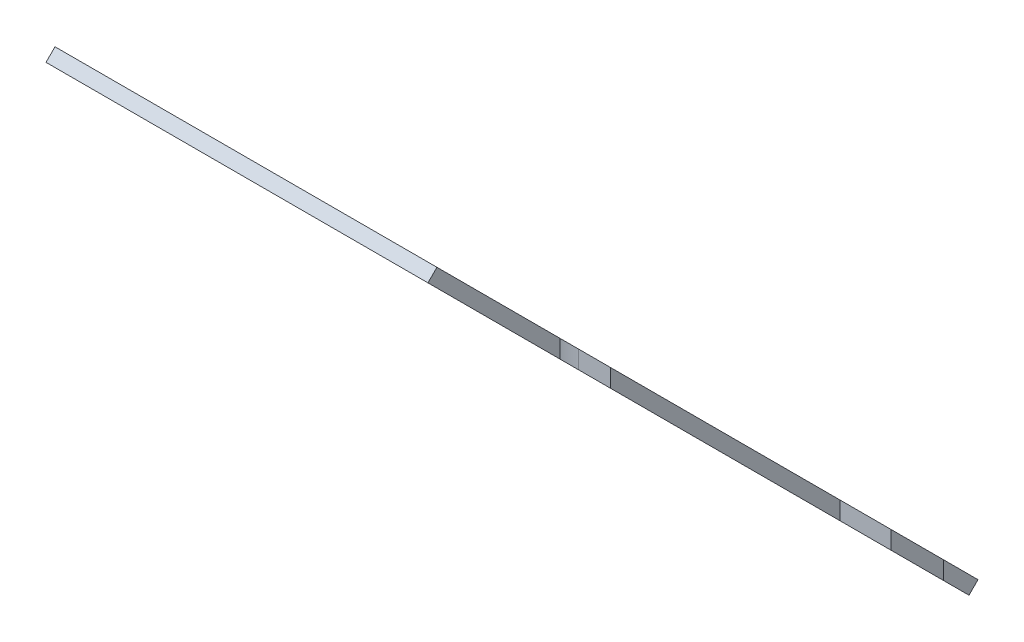
ISO-10303-21;
HEADER;
FILE_DESCRIPTION(('STEP AP214'),'2;1');
FILE_NAME('part.step','',(''),(''),'','','');
FILE_SCHEMA(('AUTOMOTIVE_DESIGN { 1 0 10303 214 1 1 1 1 }'));
ENDSEC;
DATA;
#1=APPLICATION_CONTEXT('core data for automotive mechanical design processes');
#2=APPLICATION_PROTOCOL_DEFINITION('international standard','automotive_design',2000,#1);
#3=PRODUCT_CONTEXT('',#1,'mechanical');
#4=PRODUCT('Part','Part','',(#3));
#5=PRODUCT_RELATED_PRODUCT_CATEGORY('part','',(#4));
#6=PRODUCT_DEFINITION_FORMATION('','',#4);
#7=PRODUCT_DEFINITION_CONTEXT('part definition',#1,'design');
#8=PRODUCT_DEFINITION('design','',#6,#7);
#9=PRODUCT_DEFINITION_SHAPE('','',#8);
#10=(LENGTH_UNIT() NAMED_UNIT(*) SI_UNIT(.MILLI.,.METRE.));
#11=(NAMED_UNIT(*) PLANE_ANGLE_UNIT() SI_UNIT($,.RADIAN.));
#12=(NAMED_UNIT(*) SI_UNIT($,.STERADIAN.) SOLID_ANGLE_UNIT());
#13=UNCERTAINTY_MEASURE_WITH_UNIT(LENGTH_MEASURE(1.E-05),#10,'distance_accuracy_value','');
#14=(GEOMETRIC_REPRESENTATION_CONTEXT(3) GLOBAL_UNCERTAINTY_ASSIGNED_CONTEXT((#13)) GLOBAL_UNIT_ASSIGNED_CONTEXT((#10,
#11,#12)) REPRESENTATION_CONTEXT('',''));
#15=CARTESIAN_POINT('',(0.,0.,0.));
#16=DIRECTION('',(0.,0.,1.));
#17=DIRECTION('',(1.,0.,0.));
#18=AXIS2_PLACEMENT_3D('',#15,#16,#17);
#19=CARTESIAN_POINT('',(-23399.5611417374,4827.85712854684,40199.9001960557));
#20=DIRECTION('',(0.,0.,-1.));
#21=DIRECTION('',(-1.,0.,0.));
#22=AXIS2_PLACEMENT_3D('',#19,#20,#21);
#23=PLANE('',#22);
#24=DIRECTION('',(1.,0.,0.));
#25=VECTOR('',#24,1.);
#26=CARTESIAN_POINT('',(-23399.5611417374,2810.99010375556,40199.9001960557));
#27=LINE('',#26,#25);
#28=CARTESIAN_POINT('',(-22901.5611417374,2810.99010375556,40199.9001960557));
#29=VERTEX_POINT('',#28);
#30=CARTESIAN_POINT('',(-22799.5611417374,2810.99010375556,40199.9001960557));
#31=VERTEX_POINT('',#30);
#32=EDGE_CURVE('E550',#29,#31,#27,.T.);
#33=ORIENTED_EDGE('',*,*,#32,.F.);
#34=DIRECTION('',(0.,1.,0.));
#35=VECTOR('',#34,1.);
#36=CARTESIAN_POINT('',(-22901.5611417374,0.,40199.9001960557));
#37=LINE('',#36,#35);
#38=CARTESIAN_POINT('',(-22901.5611417374,2839.27437500302,40199.9001960557));
#39=VERTEX_POINT('',#38);
#40=EDGE_CURVE('E492',#29,#39,#37,.T.);
#41=ORIENTED_EDGE('',*,*,#40,.T.);
#42=DIRECTION('',(1.,0.,0.));
#43=VECTOR('',#42,1.);
#44=CARTESIAN_POINT('',(-23399.5611417374,2839.27437500302,40199.9001960557));
#45=LINE('',#44,#43);
#46=CARTESIAN_POINT('',(-22799.5611417374,2839.27437500302,40199.9001960557));
#47=VERTEX_POINT('',#46);
#48=EDGE_CURVE('E571',#39,#47,#45,.T.);
#49=ORIENTED_EDGE('',*,*,#48,.T.);
#50=DIRECTION('',(0.,1.,0.));
#51=VECTOR('',#50,1.);
#52=CARTESIAN_POINT('',(-22799.5611417374,4827.85712854684,40199.9001960557));
#53=LINE('',#52,#51);
#54=EDGE_CURVE('E554',#31,#47,#53,.T.);
#55=ORIENTED_EDGE('',*,*,#54,.F.);
#56=EDGE_LOOP('',(#33,#41,#49,#55));
#57=FACE_BOUND('',#56,.T.);
#58=ADVANCED_FACE('F135',(#57),#23,.T.);
#59=CARTESIAN_POINT('',(-22799.5611417376,0.,1.12500434359583E-10));
#60=DIRECTION('',(-1.,0.,0.));
#61=DIRECTION('',(0.,0.,1.));
#62=AXIS2_PLACEMENT_3D('',#59,#60,#61);
#63=PLANE('',#62);
#64=DIRECTION('',(0.,-0.70710678118655,-0.707106781186545));
#65=VECTOR('',#64,1.);
#66=CARTESIAN_POINT('',(-22799.5611417374,3819.42361615121,41208.3337084514));
#67=LINE('',#66,#65);
#68=CARTESIAN_POINT('',(-22799.5611417374,3333.6901037565,40722.6001960567));
#69=VERTEX_POINT('',#68);
#70=CARTESIAN_POINT('',(-22799.5611417374,2973.69010375672,40362.6001960569));
#71=VERTEX_POINT('',#70);
#72=EDGE_CURVE('E555',#69,#71,#67,.T.);
#73=ORIENTED_EDGE('',*,*,#72,.T.);
#74=DIRECTION('',(0.,1.,0.));
#75=VECTOR('',#74,1.);
#76=CARTESIAN_POINT('',(-22799.5611417374,0.,40362.6001960569));
#77=LINE('',#76,#75);
#78=CARTESIAN_POINT('',(-22799.5611417374,3001.97437500418,40362.6001960569));
#79=VERTEX_POINT('',#78);
#80=EDGE_CURVE('E582',#71,#79,#77,.T.);
#81=ORIENTED_EDGE('',*,*,#80,.T.);
#82=DIRECTION('',(0.,0.707106781186551,0.707106781186544));
#83=VECTOR('',#82,1.);
#84=CARTESIAN_POINT('',(-22799.5611417374,3833.56575177494,41194.1915728277));
#85=LINE('',#84,#83);
#86=CARTESIAN_POINT('',(-22799.5611417374,3361.97437500396,40722.6001960567));
#87=VERTEX_POINT('',#86);
#88=EDGE_CURVE('E562',#79,#87,#85,.T.);
#89=ORIENTED_EDGE('',*,*,#88,.T.);
#90=DIRECTION('',(0.,-1.,0.));
#91=VECTOR('',#90,1.);
#92=CARTESIAN_POINT('',(-22799.5611417374,0.,40722.6001960567));
#93=LINE('',#92,#91);
#94=EDGE_CURVE('E567',#87,#69,#93,.T.);
#95=ORIENTED_EDGE('',*,*,#94,.T.);
#96=EDGE_LOOP('',(#73,#81,#89,#95));
#97=FACE_BOUND('',#96,.T.);
#98=ADVANCED_FACE('F603',(#97),#63,.F.);
#99=CARTESIAN_POINT('',(-22799.5611417374,3620.81394389631,41009.7240361965));
#100=VERTEX_POINT('',#99);
#101=CARTESIAN_POINT('',(-22799.5611417374,3413.6901037565,40802.6001960567));
#102=VERTEX_POINT('',#101);
#103=EDGE_CURVE('E551',#100,#102,#67,.T.);
#104=ORIENTED_EDGE('',*,*,#103,.T.);
#105=DIRECTION('',(0.,1.,0.));
#106=VECTOR('',#105,1.);
#107=CARTESIAN_POINT('',(-22799.5611417374,0.,40802.6001960567));
#108=LINE('',#107,#106);
#109=CARTESIAN_POINT('',(-22799.5611417374,3441.97437500396,40802.6001960567));
#110=VERTEX_POINT('',#109);
#111=EDGE_CURVE('E576',#102,#110,#108,.T.);
#112=ORIENTED_EDGE('',*,*,#111,.T.);
#113=CARTESIAN_POINT('',(-22799.5611417374,3634.95607952004,40995.5819005727));
#114=VERTEX_POINT('',#113);
#115=EDGE_CURVE('E558',#110,#114,#85,.T.);
#116=ORIENTED_EDGE('',*,*,#115,.T.);
#117=DIRECTION('',(0.,-0.70710678118657,0.707106781186525));
#118=VECTOR('',#117,1.);
#119=CARTESIAN_POINT('',(-22799.5611417374,4629.24745629198,40001.2905238009));
#120=LINE('',#119,#118);
#121=EDGE_CURVE('E544',#114,#100,#120,.T.);
#122=ORIENTED_EDGE('',*,*,#121,.T.);
#123=EDGE_LOOP('',(#104,#112,#116,#122));
#124=FACE_BOUND('',#123,.T.);
#125=ADVANCED_FACE('F644',(#124),#63,.F.);
#126=CARTESIAN_POINT('',(-23399.5611417374,3819.42361615121,41208.3337084514));
#127=DIRECTION('',(0.,-0.707106781186545,0.70710678118655));
#128=DIRECTION('',(0.,-0.70710678118655,-0.707106781186545));
#129=AXIS2_PLACEMENT_3D('',#126,#127,#128);
#130=PLANE('',#129);
#131=CARTESIAN_POINT('',(-23359.5611417374,2792.61401178209,40181.5241040823));
#132=DIRECTION('',(0.,-0.707106781186545,0.70710678118655));
#133=DIRECTION('',(0.,-0.70710678118655,-0.707106781186545));
#134=AXIS2_PLACEMENT_3D('',#131,#132,#133);
#135=CIRCLE('',#134,10.0000000000051);
#136=CARTESIAN_POINT('',(-23369.5611417374,2792.61401178209,40181.5241040823));
#137=VERTEX_POINT('',#136);
#138=CARTESIAN_POINT('',(-23359.5611417374,2785.54294397022,40174.4530362704));
#139=VERTEX_POINT('',#138);
#140=EDGE_CURVE('E461',#137,#139,#135,.T.);
#141=ORIENTED_EDGE('',*,*,#140,.F.);
#142=DIRECTION('',(0.,-0.70710678118655,-0.707106781186545));
#143=VECTOR('',#142,1.);
#144=CARTESIAN_POINT('',(-23369.5611417374,3819.42361615121,41208.3337084514));
#145=LINE('',#144,#143);
#146=CARTESIAN_POINT('',(-23369.5611417374,3359.7136502937,40748.6237425939));
#147=VERTEX_POINT('',#146);
#148=EDGE_CURVE('E451',#147,#137,#145,.T.);
#149=ORIENTED_EDGE('',*,*,#148,.F.);
#150=CARTESIAN_POINT('',(-23359.5611417374,3359.7136502937,40748.6237425939));
#151=DIRECTION('',(0.,-0.707106781186545,0.70710678118655));
#152=DIRECTION('',(0.,-0.70710678118655,-0.707106781186545));
#153=AXIS2_PLACEMENT_3D('',#150,#151,#152);
#154=CIRCLE('',#153,10.000000000001);
#155=CARTESIAN_POINT('',(-23359.5611417374,3366.78471810557,40755.6948104057));
#156=VERTEX_POINT('',#155);
#157=EDGE_CURVE('E486',#156,#147,#154,.T.);
#158=ORIENTED_EDGE('',*,*,#157,.F.);
#159=DIRECTION('',(-1.,0.,0.));
#160=VECTOR('',#159,1.);
#161=CARTESIAN_POINT('',(-23399.5611417374,3366.78471810557,40755.6948104057));
#162=LINE('',#161,#160);
#163=CARTESIAN_POINT('',(-22990.4388582626,3366.78471810557,40755.6948104057));
#164=VERTEX_POINT('',#163);
#165=EDGE_CURVE('E480',#164,#156,#162,.T.);
#166=ORIENTED_EDGE('',*,*,#165,.F.);
#167=CARTESIAN_POINT('',(-22990.4388582626,3359.7136502937,40748.6237425939));
#168=DIRECTION('',(0.,-0.707106781186545,0.70710678118655));
#169=DIRECTION('',(0.,-0.70710678118655,-0.707106781186545));
#170=AXIS2_PLACEMENT_3D('',#167,#168,#169);
#171=CIRCLE('',#170,10.000000000001);
#172=CARTESIAN_POINT('',(-22990.4388582626,3352.64258248184,40741.552674782));
#173=VERTEX_POINT('',#172);
#174=EDGE_CURVE('E351',#173,#164,#171,.T.);
#175=ORIENTED_EDGE('',*,*,#174,.F.);
#176=DIRECTION('',(-1.,0.,0.));
#177=VECTOR('',#176,1.);
#178=CARTESIAN_POINT('',(-23399.5611417374,3352.64258248184,40741.552674782));
#179=LINE('',#178,#177);
#180=CARTESIAN_POINT('',(-23349.5611417374,3352.64258248184,40741.552674782));
#181=VERTEX_POINT('',#180);
#182=EDGE_CURVE('E483',#173,#181,#179,.T.);
#183=ORIENTED_EDGE('',*,*,#182,.T.);
#184=DIRECTION('',(0.,-0.70710678118655,-0.707106781186545));
#185=VECTOR('',#184,1.);
#186=CARTESIAN_POINT('',(-23349.5611417374,3819.42361615121,41208.3337084514));
#187=LINE('',#186,#185);
#188=CARTESIAN_POINT('',(-23349.5611417374,3239.50549749199,40628.4155897922));
#189=VERTEX_POINT('',#188);
#190=EDGE_CURVE('E381',#181,#189,#187,.T.);
#191=ORIENTED_EDGE('',*,*,#190,.T.);
#192=DIRECTION('',(-1.,0.,0.));
#193=VECTOR('',#192,1.);
#194=CARTESIAN_POINT('',(-23399.5611417374,3239.50549749199,40628.4155897922));
#195=LINE('',#194,#193);
#196=CARTESIAN_POINT('',(-22990.4388582626,3239.50549749199,40628.4155897922));
#197=VERTEX_POINT('',#196);
#198=EDGE_CURVE('E449',#197,#189,#195,.T.);
#199=ORIENTED_EDGE('',*,*,#198,.F.);
#200=CARTESIAN_POINT('',(-22990.4388582626,3232.43442968012,40621.3445219803));
#201=DIRECTION('',(0.,-0.707106781186545,0.70710678118655));
#202=DIRECTION('',(0.,-0.70710678118655,-0.707106781186545));
#203=AXIS2_PLACEMENT_3D('',#200,#201,#202);
#204=CIRCLE('',#203,10.0000000000048);
#205=CARTESIAN_POINT('',(-22990.4388582626,3225.36336186825,40614.2734541684));
#206=VERTEX_POINT('',#205);
#207=EDGE_CURVE('E453',#206,#197,#204,.T.);
#208=ORIENTED_EDGE('',*,*,#207,.F.);
#209=DIRECTION('',(-1.,0.,0.));
#210=VECTOR('',#209,1.);
#211=CARTESIAN_POINT('',(-23399.5611417374,3225.36336186825,40614.2734541684));
#212=LINE('',#211,#210);
#213=CARTESIAN_POINT('',(-23349.5611417374,3225.36336186825,40614.2734541684));
#214=VERTEX_POINT('',#213);
#215=EDGE_CURVE('E455',#206,#214,#212,.T.);
#216=ORIENTED_EDGE('',*,*,#215,.T.);
#217=DIRECTION('',(0.,-0.70710678118655,-0.707106781186545));
#218=VECTOR('',#217,1.);
#219=CARTESIAN_POINT('',(-23349.5611417374,3819.42361615121,41208.3337084514));
#220=LINE('',#219,#218);
#221=CARTESIAN_POINT('',(-23349.5611417374,2926.96430020753,40315.8743925077));
#222=VERTEX_POINT('',#221);
#223=EDGE_CURVE('E458',#214,#222,#220,.T.);
#224=ORIENTED_EDGE('',*,*,#223,.T.);
#225=DIRECTION('',(1.,0.,0.));
#226=VECTOR('',#225,1.);
#227=CARTESIAN_POINT('',(-23399.5611417374,2926.96430020753,40315.8743925077));
#228=LINE('',#227,#226);
#229=CARTESIAN_POINT('',(-23159.5611417374,2926.96430020753,40315.8743925077));
#230=VERTEX_POINT('',#229);
#231=EDGE_CURVE('E463',#222,#230,#228,.T.);
#232=ORIENTED_EDGE('',*,*,#231,.T.);
#233=CARTESIAN_POINT('',(-23159.5611417374,2919.89323239567,40308.8033246958));
#234=DIRECTION('',(0.,-0.707106781186545,0.70710678118655));
#235=DIRECTION('',(0.,-0.70710678118655,-0.707106781186545));
#236=AXIS2_PLACEMENT_3D('',#233,#234,#235);
#237=CIRCLE('',#236,9.99999999999973);
#238=CARTESIAN_POINT('',(-23159.5611417374,2912.8221645838,40301.732256884));
#239=VERTEX_POINT('',#238);
#240=EDGE_CURVE('E471',#239,#230,#237,.T.);
#241=ORIENTED_EDGE('',*,*,#240,.F.);
#242=DIRECTION('',(1.,0.,0.));
#243=VECTOR('',#242,1.);
#244=CARTESIAN_POINT('',(-23399.5611417374,2912.8221645838,40301.732256884));
#245=LINE('',#244,#243);
#246=CARTESIAN_POINT('',(-23349.5611417374,2912.8221645838,40301.732256884));
#247=VERTEX_POINT('',#246);
#248=EDGE_CURVE('E473',#247,#239,#245,.T.);
#249=ORIENTED_EDGE('',*,*,#248,.F.);
#250=DIRECTION('',(0.,-0.70710678118655,-0.707106781186545));
#251=VECTOR('',#250,1.);
#252=CARTESIAN_POINT('',(-23349.5611417374,3819.42361615121,41208.3337084514));
#253=LINE('',#252,#251);
#254=CARTESIAN_POINT('',(-23349.5611417374,2799.68507959396,40188.5951718941));
#255=VERTEX_POINT('',#254);
#256=EDGE_CURVE('E466',#247,#255,#253,.T.);
#257=ORIENTED_EDGE('',*,*,#256,.T.);
#258=DIRECTION('',(1.,0.,0.));
#259=VECTOR('',#258,1.);
#260=CARTESIAN_POINT('',(-23399.5611417374,2799.68507959396,40188.5951718941));
#261=LINE('',#260,#259);
#262=CARTESIAN_POINT('',(-23159.5611417374,2799.68507959396,40188.5951718941));
#263=VERTEX_POINT('',#262);
#264=EDGE_CURVE('E475',#255,#263,#261,.T.);
#265=ORIENTED_EDGE('',*,*,#264,.T.);
#266=CARTESIAN_POINT('',(-23159.5611417374,2792.61401178209,40181.5241040823));
#267=DIRECTION('',(0.,-0.707106781186545,0.70710678118655));
#268=DIRECTION('',(0.,-0.70710678118655,-0.707106781186545));
#269=AXIS2_PLACEMENT_3D('',#266,#267,#268);
#270=CIRCLE('',#269,10.0000000000035);
#271=CARTESIAN_POINT('',(-23159.5611417374,2785.54294397022,40174.4530362704));
#272=VERTEX_POINT('',#271);
#273=EDGE_CURVE('E478',#272,#263,#270,.T.);
#274=ORIENTED_EDGE('',*,*,#273,.F.);
#275=DIRECTION('',(1.,0.,0.));
#276=VECTOR('',#275,1.);
#277=CARTESIAN_POINT('',(-23399.5611417374,2785.54294397022,40174.4530362704));
#278=LINE('',#277,#276);
#279=EDGE_CURVE('E469',#139,#272,#278,.T.);
#280=ORIENTED_EDGE('',*,*,#279,.F.);
#281=EDGE_LOOP('',(#141,#149,#158,#166,#175,#183,#191,#199,#208,#216,#224,#232,#241,#249,#257,
#265,#274,#280));
#282=FACE_BOUND('',#281,.T.);
#283=DIRECTION('',(-1.,0.,0.));
#284=VECTOR('',#283,1.);
#285=CARTESIAN_POINT('',(-23399.5611417374,2973.69010375672,40362.6001960569));
#286=LINE('',#285,#284);
#287=CARTESIAN_POINT('',(-23030.5611417375,2973.69010375672,40362.6001960569));
#288=VERTEX_POINT('',#287);
#289=EDGE_CURVE('E534',#71,#288,#286,.T.);
#290=ORIENTED_EDGE('',*,*,#289,.F.);
#291=ORIENTED_EDGE('',*,*,#72,.F.);
#292=DIRECTION('',(1.,0.,0.));
#293=VECTOR('',#292,1.);
#294=CARTESIAN_POINT('',(-23399.5611417374,3333.69010375651,40722.6001960567));
#295=LINE('',#294,#293);
#296=CARTESIAN_POINT('',(-22850.5611417385,3333.69010375651,40722.6001960567));
#297=VERTEX_POINT('',#296);
#298=EDGE_CURVE('E522',#297,#69,#295,.T.);
#299=ORIENTED_EDGE('',*,*,#298,.F.);
#300=CARTESIAN_POINT('',(-22850.5611417385,3373.6901037565,40762.6001960567));
#301=DIRECTION('',(0.,-0.707106781186545,0.70710678118655));
#302=DIRECTION('',(0.,0.70710678118655,0.707106781186545));
#303=AXIS2_PLACEMENT_3D('',#300,#301,#302);
#304=ELLIPSE('',#303,56.5685424949228,39.9999999999991);
#305=CARTESIAN_POINT('',(-22850.5611417385,3413.6901037565,40802.6001960567));
#306=VERTEX_POINT('',#305);
#307=EDGE_CURVE('E536',#306,#297,#304,.T.);
#308=ORIENTED_EDGE('',*,*,#307,.F.);
#309=DIRECTION('',(-1.,0.,0.));
#310=VECTOR('',#309,1.);
#311=CARTESIAN_POINT('',(-23399.5611417374,3413.6901037565,40802.6001960567));
#312=LINE('',#311,#310);
#313=EDGE_CURVE('E526',#102,#306,#312,.T.);
#314=ORIENTED_EDGE('',*,*,#313,.F.);
#315=ORIENTED_EDGE('',*,*,#103,.F.);
#316=DIRECTION('',(1.,0.,0.));
#317=VECTOR('',#316,1.);
#318=CARTESIAN_POINT('',(-23399.5611417374,3620.81394389631,41009.7240361965));
#319=LINE('',#318,#317);
#320=CARTESIAN_POINT('',(-23399.5611417374,3620.81394389631,41009.7240361965));
#321=VERTEX_POINT('',#320);
#322=EDGE_CURVE('E565',#321,#100,#319,.T.);
#323=ORIENTED_EDGE('',*,*,#322,.F.);
#324=DIRECTION('',(0.,-0.70710678118655,-0.707106781186545));
#325=VECTOR('',#324,1.);
#326=CARTESIAN_POINT('',(-23399.5611417374,3819.42361615121,41208.3337084514));
#327=LINE('',#326,#325);
#328=CARTESIAN_POINT('',(-23399.5611417374,2668.87032507444,40057.7804173746));
#329=VERTEX_POINT('',#328);
#330=EDGE_CURVE('E541',#321,#329,#327,.T.);
#331=ORIENTED_EDGE('',*,*,#330,.T.);
#332=DIRECTION('',(-1.,0.,0.));
#333=VECTOR('',#332,1.);
#334=CARTESIAN_POINT('',(-22670.3570628498,2668.87032507444,40057.7804173746));
#335=LINE('',#334,#333);
#336=CARTESIAN_POINT('',(-22901.5611417374,2668.87032507444,40057.7804173746));
#337=VERTEX_POINT('',#336);
#338=EDGE_CURVE('E493',#337,#329,#335,.T.);
#339=ORIENTED_EDGE('',*,*,#338,.F.);
#340=DIRECTION('',(0.,0.707106781186551,0.707106781186544));
#341=VECTOR('',#340,1.);
#342=CARTESIAN_POINT('',(-22901.5611417374,-18694.4550461501,18694.4550461503));
#343=LINE('',#342,#341);
#344=EDGE_CURVE('E489',#337,#29,#343,.T.);
#345=ORIENTED_EDGE('',*,*,#344,.T.);
#346=ORIENTED_EDGE('',*,*,#32,.T.);
#347=CARTESIAN_POINT('',(-22799.5611417374,2893.69010375672,40282.6001960569));
#348=VERTEX_POINT('',#347);
#349=EDGE_CURVE('E540',#348,#31,#67,.T.);
#350=ORIENTED_EDGE('',*,*,#349,.F.);
#351=DIRECTION('',(1.,0.,0.));
#352=VECTOR('',#351,1.);
#353=CARTESIAN_POINT('',(-23399.5611417374,2893.69010375672,40282.6001960569));
#354=LINE('',#353,#352);
#355=CARTESIAN_POINT('',(-23030.5611417375,2893.69010375672,40282.6001960569));
#356=VERTEX_POINT('',#355);
#357=EDGE_CURVE('E530',#356,#348,#354,.T.);
#358=ORIENTED_EDGE('',*,*,#357,.F.);
#359=CARTESIAN_POINT('',(-23030.5611417375,2933.69010375672,40322.6001960569));
#360=DIRECTION('',(0.,-0.707106781186545,0.70710678118655));
#361=DIRECTION('',(0.,0.70710678118655,0.707106781186545));
#362=AXIS2_PLACEMENT_3D('',#359,#360,#361);
#363=ELLIPSE('',#362,56.5685424949228,39.9999999999991);
#364=EDGE_CURVE('E538',#288,#356,#363,.T.);
#365=ORIENTED_EDGE('',*,*,#364,.F.);
#366=EDGE_LOOP('',(#290,#291,#299,#308,#314,#315,#323,#331,#339,#345,#346,#350,#358,#365));
#367=FACE_BOUND('',#366,.T.);
#368=ADVANCED_FACE('F137',(#282,#367),#130,.T.);
#369=CARTESIAN_POINT('',(-23399.5611417374,4629.24745629198,40001.2905238009));
#370=DIRECTION('',(0.,0.707106781186525,0.70710678118657));
#371=DIRECTION('',(0.,-0.70710678118657,0.707106781186525));
#372=AXIS2_PLACEMENT_3D('',#369,#370,#371);
#373=PLANE('',#372);
#374=ORIENTED_EDGE('',*,*,#121,.F.);
#375=DIRECTION('',(1.,0.,0.));
#376=VECTOR('',#375,1.);
#377=CARTESIAN_POINT('',(-23399.5611417374,3634.95607952004,40995.5819005727));
#378=LINE('',#377,#376);
#379=CARTESIAN_POINT('',(-23399.5611417374,3634.95607952004,40995.5819005727));
#380=VERTEX_POINT('',#379);
#381=EDGE_CURVE('E568',#380,#114,#378,.T.);
#382=ORIENTED_EDGE('',*,*,#381,.F.);
#383=DIRECTION('',(0.,-0.70710678118657,0.707106781186525));
#384=VECTOR('',#383,1.);
#385=CARTESIAN_POINT('',(-23399.5611417374,4629.24745629198,40001.2905238009));
#386=LINE('',#385,#384);
#387=EDGE_CURVE('E547',#380,#321,#386,.T.);
#388=ORIENTED_EDGE('',*,*,#387,.T.);
#389=ORIENTED_EDGE('',*,*,#322,.T.);
#390=EDGE_LOOP('',(#374,#382,#388,#389));
#391=FACE_BOUND('',#390,.T.);
#392=ADVANCED_FACE('F650',(#391),#373,.T.);
#393=CARTESIAN_POINT('',(-23399.5611417374,3833.56575177494,41194.1915728277));
#394=DIRECTION('',(0.,0.707106781186544,-0.707106781186551));
#395=DIRECTION('',(0.,0.707106781186551,0.707106781186544));
#396=AXIS2_PLACEMENT_3D('',#393,#394,#395);
#397=PLANE('',#396);
#398=CARTESIAN_POINT('',(-23359.5611417374,2806.75614740581,40167.3819684585));
#399=DIRECTION('',(0.,0.707106781186544,-0.707106781186551));
#400=DIRECTION('',(0.,0.707106781186551,0.707106781186544));
#401=AXIS2_PLACEMENT_3D('',#398,#399,#400);
#402=CIRCLE('',#401,10.0000000000051);
#403=CARTESIAN_POINT('',(-23359.5611417374,2799.68507959394,40160.3109006467));
#404=VERTEX_POINT('',#403);
#405=CARTESIAN_POINT('',(-23369.5611417374,2806.75614740581,40167.3819684585));
#406=VERTEX_POINT('',#405);
#407=EDGE_CURVE('E382',#404,#406,#402,.T.);
#408=ORIENTED_EDGE('',*,*,#407,.F.);
#409=DIRECTION('',(-1.,0.,0.));
#410=VECTOR('',#409,1.);
#411=CARTESIAN_POINT('',(-23159.5611417374,2799.68507959395,40160.3109006467));
#412=LINE('',#411,#410);
#413=CARTESIAN_POINT('',(-23159.5611417374,2799.68507959395,40160.3109006467));
#414=VERTEX_POINT('',#413);
#415=EDGE_CURVE('E427',#414,#404,#412,.T.);
#416=ORIENTED_EDGE('',*,*,#415,.F.);
#417=CARTESIAN_POINT('',(-23159.5611417374,2806.75614740581,40167.3819684585));
#418=DIRECTION('',(0.,0.707106781186544,-0.707106781186551));
#419=DIRECTION('',(0.,0.707106781186551,0.707106781186544));
#420=AXIS2_PLACEMENT_3D('',#417,#418,#419);
#421=CIRCLE('',#420,10.0000000000035);
#422=CARTESIAN_POINT('',(-23159.5611417374,2813.82721521768,40174.4530362704));
#423=VERTEX_POINT('',#422);
#424=EDGE_CURVE('E424',#423,#414,#421,.T.);
#425=ORIENTED_EDGE('',*,*,#424,.F.);
#426=DIRECTION('',(-1.,0.,0.));
#427=VECTOR('',#426,1.);
#428=CARTESIAN_POINT('',(-23159.5611417374,2813.82721521768,40174.4530362704));
#429=LINE('',#428,#427);
#430=CARTESIAN_POINT('',(-23349.5611417374,2813.82721521768,40174.4530362704));
#431=VERTEX_POINT('',#430);
#432=EDGE_CURVE('E430',#423,#431,#429,.T.);
#433=ORIENTED_EDGE('',*,*,#432,.T.);
#434=DIRECTION('',(0.,0.707106781186552,0.707106781186543));
#435=VECTOR('',#434,1.);
#436=CARTESIAN_POINT('',(-23349.5611417374,2806.75614740581,40167.3819684585));
#437=LINE('',#436,#435);
#438=CARTESIAN_POINT('',(-23349.5611417374,2926.96430020753,40287.5901212603));
#439=VERTEX_POINT('',#438);
#440=EDGE_CURVE('E391',#431,#439,#437,.T.);
#441=ORIENTED_EDGE('',*,*,#440,.T.);
#442=DIRECTION('',(-1.,0.,0.));
#443=VECTOR('',#442,1.);
#444=CARTESIAN_POINT('',(-23159.5611417374,2926.96430020753,40287.5901212603));
#445=LINE('',#444,#443);
#446=CARTESIAN_POINT('',(-23159.5611417374,2926.96430020753,40287.5901212603));
#447=VERTEX_POINT('',#446);
#448=EDGE_CURVE('E414',#447,#439,#445,.T.);
#449=ORIENTED_EDGE('',*,*,#448,.F.);
#450=CARTESIAN_POINT('',(-23159.5611417374,2934.03536801939,40294.6611890721));
#451=DIRECTION('',(0.,0.707106781186544,-0.707106781186551));
#452=DIRECTION('',(0.,0.707106781186551,0.707106781186544));
#453=AXIS2_PLACEMENT_3D('',#450,#451,#452);
#454=CIRCLE('',#453,9.99999999999973);
#455=CARTESIAN_POINT('',(-23159.5611417374,2941.10643583126,40301.732256884));
#456=VERTEX_POINT('',#455);
#457=EDGE_CURVE('E411',#456,#447,#454,.T.);
#458=ORIENTED_EDGE('',*,*,#457,.F.);
#459=DIRECTION('',(-1.,0.,0.));
#460=VECTOR('',#459,1.);
#461=CARTESIAN_POINT('',(-23159.5611417374,2941.10643583126,40301.732256884));
#462=LINE('',#461,#460);
#463=CARTESIAN_POINT('',(-23349.5611417374,2941.10643583126,40301.732256884));
#464=VERTEX_POINT('',#463);
#465=EDGE_CURVE('E418',#456,#464,#462,.T.);
#466=ORIENTED_EDGE('',*,*,#465,.T.);
#467=CARTESIAN_POINT('',(-23349.5611417374,3239.50549749198,40600.1313185447));
#468=VERTEX_POINT('',#467);
#469=EDGE_CURVE('E390',#464,#468,#437,.T.);
#470=ORIENTED_EDGE('',*,*,#469,.T.);
#471=DIRECTION('',(1.,0.,0.));
#472=VECTOR('',#471,1.);
#473=CARTESIAN_POINT('',(-23359.5611417374,3239.50549749198,40600.1313185447));
#474=LINE('',#473,#472);
#475=CARTESIAN_POINT('',(-22990.4388582626,3239.50549749198,40600.1313185447));
#476=VERTEX_POINT('',#475);
#477=EDGE_CURVE('E405',#468,#476,#474,.T.);
#478=ORIENTED_EDGE('',*,*,#477,.T.);
#479=CARTESIAN_POINT('',(-22990.4388582626,3246.57656530385,40607.2023863566));
#480=DIRECTION('',(0.,0.707106781186544,-0.707106781186551));
#481=DIRECTION('',(0.,0.707106781186551,0.707106781186544));
#482=AXIS2_PLACEMENT_3D('',#479,#480,#481);
#483=CIRCLE('',#482,10.0000000000048);
#484=CARTESIAN_POINT('',(-22990.4388582626,3253.64763311572,40614.2734541684));
#485=VERTEX_POINT('',#484);
#486=EDGE_CURVE('E401',#485,#476,#483,.T.);
#487=ORIENTED_EDGE('',*,*,#486,.F.);
#488=DIRECTION('',(1.,0.,0.));
#489=VECTOR('',#488,1.);
#490=CARTESIAN_POINT('',(-23359.5611417374,3253.64763311572,40614.2734541684));
#491=LINE('',#490,#489);
#492=CARTESIAN_POINT('',(-23349.5611417374,3253.64763311572,40614.2734541684));
#493=VERTEX_POINT('',#492);
#494=EDGE_CURVE('E398',#493,#485,#491,.T.);
#495=ORIENTED_EDGE('',*,*,#494,.F.);
#496=CARTESIAN_POINT('',(-23349.5611417374,3366.78471810556,40727.4105391583));
#497=VERTEX_POINT('',#496);
#498=EDGE_CURVE('E388',#493,#497,#437,.T.);
#499=ORIENTED_EDGE('',*,*,#498,.T.);
#500=DIRECTION('',(1.,0.,0.));
#501=VECTOR('',#500,1.);
#502=CARTESIAN_POINT('',(1.46649092133354E-12,3366.78471810556,40727.4105391583));
#503=LINE('',#502,#501);
#504=CARTESIAN_POINT('',(-22990.4388582626,3366.78471810556,40727.4105391583));
#505=VERTEX_POINT('',#504);
#506=EDGE_CURVE('E158',#497,#505,#503,.T.);
#507=ORIENTED_EDGE('',*,*,#506,.T.);
#508=CARTESIAN_POINT('',(-22990.4388582626,3373.85578591742,40734.4816069702));
#509=DIRECTION('',(0.,0.707106781186544,-0.707106781186551));
#510=DIRECTION('',(0.,0.707106781186551,0.707106781186544));
#511=AXIS2_PLACEMENT_3D('',#508,#509,#510);
#512=CIRCLE('',#511,10.000000000001);
#513=CARTESIAN_POINT('',(-22990.4388582626,3380.92685372929,40741.552674782));
#514=VERTEX_POINT('',#513);
#515=EDGE_CURVE('E349',#514,#505,#512,.T.);
#516=ORIENTED_EDGE('',*,*,#515,.F.);
#517=DIRECTION('',(1.,0.,0.));
#518=VECTOR('',#517,1.);
#519=CARTESIAN_POINT('',(1.46649092133354E-12,3380.92685372929,40741.552674782));
#520=LINE('',#519,#518);
#521=CARTESIAN_POINT('',(-23359.5611417374,3380.92685372929,40741.552674782));
#522=VERTEX_POINT('',#521);
#523=EDGE_CURVE('E358',#522,#514,#520,.T.);
#524=ORIENTED_EDGE('',*,*,#523,.F.);
#525=CARTESIAN_POINT('',(-23359.5611417374,3373.85578591742,40734.4816069702));
#526=DIRECTION('',(0.,0.707106781186544,-0.707106781186551));
#527=DIRECTION('',(0.,0.707106781186551,0.707106781186544));
#528=AXIS2_PLACEMENT_3D('',#525,#526,#527);
#529=CIRCLE('',#528,10.000000000001);
#530=CARTESIAN_POINT('',(-23369.5611417374,3373.85578591742,40734.4816069702));
#531=VERTEX_POINT('',#530);
#532=EDGE_CURVE('E355',#531,#522,#529,.T.);
#533=ORIENTED_EDGE('',*,*,#532,.F.);
#534=DIRECTION('',(0.,0.707106781186552,0.707106781186543));
#535=VECTOR('',#534,1.);
#536=CARTESIAN_POINT('',(-23369.5611417374,2806.75614740581,40167.3819684585));
#537=LINE('',#536,#535);
#538=EDGE_CURVE('E385',#406,#531,#537,.T.);
#539=ORIENTED_EDGE('',*,*,#538,.F.);
#540=EDGE_LOOP('',(#408,#416,#425,#433,#441,#449,#458,#466,#470,#478,#487,#495,#499,#507,#516,
#524,#533,#539));
#541=FACE_BOUND('',#540,.T.);
#542=DIRECTION('',(1.,0.,0.));
#543=VECTOR('',#542,1.);
#544=CARTESIAN_POINT('',(-23399.5611417374,3001.97437500418,40362.6001960569));
#545=LINE('',#544,#543);
#546=CARTESIAN_POINT('',(-23030.5611417375,3001.97437500418,40362.6001960569));
#547=VERTEX_POINT('',#546);
#548=EDGE_CURVE('E532',#547,#79,#545,.T.);
#549=ORIENTED_EDGE('',*,*,#548,.F.);
#550=CARTESIAN_POINT('',(-23030.5611417375,2961.97437500418,40322.6001960569));
#551=DIRECTION('',(0.,0.707106781186544,-0.707106781186551));
#552=DIRECTION('',(0.,0.707106781186551,0.707106781186544));
#553=AXIS2_PLACEMENT_3D('',#550,#551,#552);
#554=ELLIPSE('',#553,56.5685424949229,39.9999999999991);
#555=CARTESIAN_POINT('',(-23030.5611417375,2921.97437500418,40282.6001960569));
#556=VERTEX_POINT('',#555);
#557=EDGE_CURVE('E12',#556,#547,#554,.T.);
#558=ORIENTED_EDGE('',*,*,#557,.F.);
#559=DIRECTION('',(-1.,0.,0.));
#560=VECTOR('',#559,1.);
#561=CARTESIAN_POINT('',(-23399.5611417374,2921.97437500418,40282.6001960569));
#562=LINE('',#561,#560);
#563=CARTESIAN_POINT('',(-22799.5611417374,2921.97437500418,40282.6001960569));
#564=VERTEX_POINT('',#563);
#565=EDGE_CURVE('E528',#564,#556,#562,.T.);
#566=ORIENTED_EDGE('',*,*,#565,.F.);
#567=EDGE_CURVE('E559',#47,#564,#85,.T.);
#568=ORIENTED_EDGE('',*,*,#567,.F.);
#569=ORIENTED_EDGE('',*,*,#48,.F.);
#570=DIRECTION('',(0.,-0.707106781186548,-0.707106781186548));
#571=VECTOR('',#570,1.);
#572=CARTESIAN_POINT('',(-22901.5611417374,-18680.3129105263,18680.3129105264));
#573=LINE('',#572,#571);
#574=CARTESIAN_POINT('',(-22901.5611417374,2683.01246069817,40043.6382817509));
#575=VERTEX_POINT('',#574);
#576=EDGE_CURVE('E496',#39,#575,#573,.T.);
#577=ORIENTED_EDGE('',*,*,#576,.T.);
#578=DIRECTION('',(-1.,0.,0.));
#579=VECTOR('',#578,1.);
#580=CARTESIAN_POINT('',(-22670.3570628498,2683.01246069817,40043.6382817509));
#581=LINE('',#580,#579);
#582=CARTESIAN_POINT('',(-23399.5611417374,2683.01246069817,40043.6382817509));
#583=VERTEX_POINT('',#582);
#584=EDGE_CURVE('E502',#575,#583,#581,.T.);
#585=ORIENTED_EDGE('',*,*,#584,.T.);
#586=DIRECTION('',(0.,0.707106781186551,0.707106781186544));
#587=VECTOR('',#586,1.);
#588=CARTESIAN_POINT('',(-23399.5611417374,3833.56575177494,41194.1915728277));
#589=LINE('',#588,#587);
#590=EDGE_CURVE('E543',#583,#380,#589,.T.);
#591=ORIENTED_EDGE('',*,*,#590,.T.);
#592=ORIENTED_EDGE('',*,*,#381,.T.);
#593=ORIENTED_EDGE('',*,*,#115,.F.);
#594=DIRECTION('',(1.,0.,0.));
#595=VECTOR('',#594,1.);
#596=CARTESIAN_POINT('',(-23399.5611417374,3441.97437500396,40802.6001960567));
#597=LINE('',#596,#595);
#598=CARTESIAN_POINT('',(-22850.5611417385,3441.97437500396,40802.6001960567));
#599=VERTEX_POINT('',#598);
#600=EDGE_CURVE('E524',#599,#110,#597,.T.);
#601=ORIENTED_EDGE('',*,*,#600,.F.);
#602=CARTESIAN_POINT('',(-22850.5611417385,3401.97437500396,40762.6001960567));
#603=DIRECTION('',(0.,0.707106781186544,-0.707106781186551));
#604=DIRECTION('',(0.,0.707106781186551,0.707106781186544));
#605=AXIS2_PLACEMENT_3D('',#602,#603,#604);
#606=ELLIPSE('',#605,56.5685424949229,39.9999999999991);
#607=CARTESIAN_POINT('',(-22850.5611417385,3361.97437500396,40722.6001960567));
#608=VERTEX_POINT('',#607);
#609=EDGE_CURVE('E143',#608,#599,#606,.T.);
#610=ORIENTED_EDGE('',*,*,#609,.F.);
#611=DIRECTION('',(-1.,0.,0.));
#612=VECTOR('',#611,1.);
#613=CARTESIAN_POINT('',(-23399.5611417374,3361.97437500396,40722.6001960567));
#614=LINE('',#613,#612);
#615=EDGE_CURVE('E512',#87,#608,#614,.T.);
#616=ORIENTED_EDGE('',*,*,#615,.F.);
#617=ORIENTED_EDGE('',*,*,#88,.F.);
#618=EDGE_LOOP('',(#549,#558,#566,#568,#569,#577,#585,#591,#592,#593,#601,#610,#616,#617));
#619=FACE_BOUND('',#618,.T.);
#620=ADVANCED_FACE('F368',(#541,#619),#397,.T.);
#621=CARTESIAN_POINT('',(-23399.5611417376,0.,1.12500434359583E-10));
#622=DIRECTION('',(-1.,0.,0.));
#623=DIRECTION('',(0.,0.,1.));
#624=AXIS2_PLACEMENT_3D('',#621,#622,#623);
#625=PLANE('',#624);
#626=ORIENTED_EDGE('',*,*,#330,.F.);
#627=ORIENTED_EDGE('',*,*,#387,.F.);
#628=ORIENTED_EDGE('',*,*,#590,.F.);
#629=DIRECTION('',(0.,-0.70710678118657,0.707106781186525));
#630=VECTOR('',#629,1.);
#631=CARTESIAN_POINT('',(-23399.5611417375,21363.3253712244,21363.3253712258));
#632=LINE('',#631,#630);
#633=EDGE_CURVE('E488',#583,#329,#632,.T.);
#634=ORIENTED_EDGE('',*,*,#633,.T.);
#635=EDGE_LOOP('',(#626,#627,#628,#634));
#636=FACE_BOUND('',#635,.T.);
#637=ADVANCED_FACE('F649',(#636),#625,.T.);
#638=ORIENTED_EDGE('',*,*,#567,.T.);
#639=DIRECTION('',(0.,-1.,0.));
#640=VECTOR('',#639,1.);
#641=CARTESIAN_POINT('',(-22799.5611417374,0.,40282.6001960569));
#642=LINE('',#641,#640);
#643=EDGE_CURVE('E579',#564,#348,#642,.T.);
#644=ORIENTED_EDGE('',*,*,#643,.T.);
#645=ORIENTED_EDGE('',*,*,#349,.T.);
#646=ORIENTED_EDGE('',*,*,#54,.T.);
#647=EDGE_LOOP('',(#638,#644,#645,#646));
#648=FACE_BOUND('',#647,.T.);
#649=ADVANCED_FACE('F616',(#648),#63,.F.);
#650=CARTESIAN_POINT('',(-22799.5611417374,2810.99010375556,40802.6001960567));
#651=DIRECTION('',(0.,0.,1.));
#652=DIRECTION('',(1.,0.,0.));
#653=AXIS2_PLACEMENT_3D('',#650,#651,#652);
#654=PLANE('',#653);
#655=ORIENTED_EDGE('',*,*,#313,.T.);
#656=DIRECTION('',(0.,1.,0.));
#657=VECTOR('',#656,1.);
#658=CARTESIAN_POINT('',(-22850.5611417385,2810.99010375556,40802.6001960567));
#659=LINE('',#658,#657);
#660=EDGE_CURVE('E508',#306,#599,#659,.T.);
#661=ORIENTED_EDGE('',*,*,#660,.T.);
#662=ORIENTED_EDGE('',*,*,#600,.T.);
#663=ORIENTED_EDGE('',*,*,#111,.F.);
#664=EDGE_LOOP('',(#655,#661,#662,#663));
#665=FACE_BOUND('',#664,.T.);
#666=ADVANCED_FACE('F593',(#665),#654,.F.);
#667=CARTESIAN_POINT('',(-22850.5611417385,2810.99010375556,40762.6001960567));
#668=DIRECTION('',(0.,1.,0.));
#669=DIRECTION('',(0.,0.,1.));
#670=AXIS2_PLACEMENT_3D('',#667,#668,#669);
#671=CYLINDRICAL_SURFACE('',#670,39.9999999999991);
#672=ORIENTED_EDGE('',*,*,#307,.T.);
#673=DIRECTION('',(0.,1.,0.));
#674=VECTOR('',#673,1.);
#675=CARTESIAN_POINT('',(-22850.5611417385,2810.99010375556,40722.6001960567));
#676=LINE('',#675,#674);
#677=EDGE_CURVE('E516',#297,#608,#676,.T.);
#678=ORIENTED_EDGE('',*,*,#677,.T.);
#679=ORIENTED_EDGE('',*,*,#609,.T.);
#680=ORIENTED_EDGE('',*,*,#660,.F.);
#681=EDGE_LOOP('',(#672,#678,#679,#680));
#682=FACE_BOUND('',#681,.T.);
#683=ADVANCED_FACE('F587',(#682),#671,.F.);
#684=CARTESIAN_POINT('',(-22799.5611417374,2810.99010375556,40722.6001960567));
#685=DIRECTION('',(0.,0.,-1.));
#686=DIRECTION('',(-1.,0.,0.));
#687=AXIS2_PLACEMENT_3D('',#684,#685,#686);
#688=PLANE('',#687);
#689=ORIENTED_EDGE('',*,*,#298,.T.);
#690=ORIENTED_EDGE('',*,*,#94,.F.);
#691=ORIENTED_EDGE('',*,*,#615,.T.);
#692=ORIENTED_EDGE('',*,*,#677,.F.);
#693=EDGE_LOOP('',(#689,#690,#691,#692));
#694=FACE_BOUND('',#693,.T.);
#695=ADVANCED_FACE('F607',(#694),#688,.F.);
#696=CARTESIAN_POINT('',(-22799.5611417374,2810.99010375556,40362.6001960569));
#697=DIRECTION('',(0.,0.,1.));
#698=DIRECTION('',(1.,0.,0.));
#699=AXIS2_PLACEMENT_3D('',#696,#697,#698);
#700=PLANE('',#699);
#701=ORIENTED_EDGE('',*,*,#289,.T.);
#702=DIRECTION('',(0.,1.,0.));
#703=VECTOR('',#702,1.);
#704=CARTESIAN_POINT('',(-23030.5611417375,2810.99010375556,40362.6001960569));
#705=LINE('',#704,#703);
#706=EDGE_CURVE('E509',#288,#547,#705,.T.);
#707=ORIENTED_EDGE('',*,*,#706,.T.);
#708=ORIENTED_EDGE('',*,*,#548,.T.);
#709=ORIENTED_EDGE('',*,*,#80,.F.);
#710=EDGE_LOOP('',(#701,#707,#708,#709));
#711=FACE_BOUND('',#710,.T.);
#712=ADVANCED_FACE('F630',(#711),#700,.F.);
#713=CARTESIAN_POINT('',(-23030.5611417375,2810.99010375556,40322.6001960569));
#714=DIRECTION('',(0.,1.,0.));
#715=DIRECTION('',(0.,0.,1.));
#716=AXIS2_PLACEMENT_3D('',#713,#714,#715);
#717=CYLINDRICAL_SURFACE('',#716,39.9999999999991);
#718=ORIENTED_EDGE('',*,*,#364,.T.);
#719=DIRECTION('',(0.,1.,0.));
#720=VECTOR('',#719,1.);
#721=CARTESIAN_POINT('',(-23030.5611417375,2810.99010375556,40282.6001960569));
#722=LINE('',#721,#720);
#723=EDGE_CURVE('E513',#356,#556,#722,.T.);
#724=ORIENTED_EDGE('',*,*,#723,.T.);
#725=ORIENTED_EDGE('',*,*,#557,.T.);
#726=ORIENTED_EDGE('',*,*,#706,.F.);
#727=EDGE_LOOP('',(#718,#724,#725,#726));
#728=FACE_BOUND('',#727,.T.);
#729=ADVANCED_FACE('F627',(#728),#717,.F.);
#730=CARTESIAN_POINT('',(-22799.5611417374,2810.99010375556,40282.6001960569));
#731=DIRECTION('',(0.,0.,-1.));
#732=DIRECTION('',(-1.,0.,0.));
#733=AXIS2_PLACEMENT_3D('',#730,#731,#732);
#734=PLANE('',#733);
#735=ORIENTED_EDGE('',*,*,#357,.T.);
#736=ORIENTED_EDGE('',*,*,#643,.F.);
#737=ORIENTED_EDGE('',*,*,#565,.T.);
#738=ORIENTED_EDGE('',*,*,#723,.F.);
#739=EDGE_LOOP('',(#735,#736,#737,#738));
#740=FACE_BOUND('',#739,.T.);
#741=ADVANCED_FACE('F625',(#740),#734,.F.);
#742=CARTESIAN_POINT('',(-22670.3570628499,21363.3253712244,21363.3253712258));
#743=DIRECTION('',(0.,-0.707106781186525,-0.70710678118657));
#744=DIRECTION('',(0.,0.70710678118657,-0.707106781186525));
#745=AXIS2_PLACEMENT_3D('',#742,#743,#744);
#746=PLANE('',#745);
#747=DIRECTION('',(0.,0.70710678118657,-0.707106781186525));
#748=VECTOR('',#747,1.);
#749=CARTESIAN_POINT('',(-22901.5611417374,21363.3253712244,21363.3253712258));
#750=LINE('',#749,#748);
#751=EDGE_CURVE('E499',#337,#575,#750,.T.);
#752=ORIENTED_EDGE('',*,*,#751,.F.);
#753=ORIENTED_EDGE('',*,*,#338,.T.);
#754=ORIENTED_EDGE('',*,*,#633,.F.);
#755=ORIENTED_EDGE('',*,*,#584,.F.);
#756=EDGE_LOOP('',(#752,#753,#754,#755));
#757=FACE_BOUND('',#756,.T.);
#758=ADVANCED_FACE('F663',(#757),#746,.T.);
#759=CARTESIAN_POINT('',(-22901.5611417374,4827.85712854684,40189.1001960557));
#760=DIRECTION('',(-1.,0.,0.));
#761=DIRECTION('',(0.,0.,1.));
#762=AXIS2_PLACEMENT_3D('',#759,#760,#761);
#763=PLANE('',#762);
#764=ORIENTED_EDGE('',*,*,#40,.F.);
#765=ORIENTED_EDGE('',*,*,#344,.F.);
#766=ORIENTED_EDGE('',*,*,#751,.T.);
#767=ORIENTED_EDGE('',*,*,#576,.F.);
#768=EDGE_LOOP('',(#764,#765,#766,#767));
#769=FACE_BOUND('',#768,.T.);
#770=ADVANCED_FACE('F667',(#769),#763,.F.);
#771=CARTESIAN_POINT('',(-23359.5611417374,2883.74184088277,41224.5955520048));
#772=DIRECTION('',(0.,0.707106781186544,-0.707106781186551));
#773=DIRECTION('',(0.,0.707106781186551,0.707106781186544));
#774=AXIS2_PLACEMENT_3D('',#771,#772,#773);
#775=CYLINDRICAL_SURFACE('',#774,10.000000000001);
#776=ORIENTED_EDGE('',*,*,#157,.T.);
#777=DIRECTION('',(0.,0.707106781186544,-0.707106781186551));
#778=VECTOR('',#777,1.);
#779=CARTESIAN_POINT('',(-23369.5611417374,2883.74184088277,41224.5955520048));
#780=LINE('',#779,#778);
#781=EDGE_CURVE('E378',#531,#147,#780,.F.);
#782=ORIENTED_EDGE('',*,*,#781,.F.);
#783=ORIENTED_EDGE('',*,*,#532,.T.);
#784=DIRECTION('',(0.,0.707106781186544,-0.707106781186551));
#785=VECTOR('',#784,1.);
#786=CARTESIAN_POINT('',(-23359.5611417374,2890.81290869464,41231.6666198167));
#787=LINE('',#786,#785);
#788=EDGE_CURVE('E361',#156,#522,#787,.T.);
#789=ORIENTED_EDGE('',*,*,#788,.F.);
#790=EDGE_LOOP('',(#776,#782,#783,#789));
#791=FACE_BOUND('',#790,.T.);
#792=ADVANCED_FACE('F672',(#791),#775,.F.);
#793=CARTESIAN_POINT('',(1.46649092133354E-12,2876.67077307091,41217.5244841929));
#794=DIRECTION('',(0.,0.707106781186551,0.707106781186544));
#795=DIRECTION('',(0.,-0.707106781186544,0.707106781186551));
#796=AXIS2_PLACEMENT_3D('',#793,#794,#795);
#797=PLANE('',#796);
#798=DIRECTION('',(0.,0.707106781186544,-0.707106781186551));
#799=VECTOR('',#798,1.);
#800=CARTESIAN_POINT('',(-22990.4388582626,2876.67077307091,41217.5244841929));
#801=LINE('',#800,#799);
#802=EDGE_CURVE('E354',#173,#505,#801,.T.);
#803=ORIENTED_EDGE('',*,*,#802,.T.);
#804=ORIENTED_EDGE('',*,*,#506,.F.);
#805=DIRECTION('',(0.,-0.707106781186544,0.707106781186551));
#806=VECTOR('',#805,1.);
#807=CARTESIAN_POINT('',(-23349.5611417374,2876.67077307091,41217.5244841929));
#808=LINE('',#807,#806);
#809=EDGE_CURVE('E376',#497,#181,#808,.T.);
#810=ORIENTED_EDGE('',*,*,#809,.T.);
#811=ORIENTED_EDGE('',*,*,#182,.F.);
#812=EDGE_LOOP('',(#803,#804,#810,#811));
#813=FACE_BOUND('',#812,.T.);
#814=ADVANCED_FACE('F675',(#813),#797,.T.);
#815=CARTESIAN_POINT('',(-22990.4388582626,2883.74184088277,41224.5955520048));
#816=DIRECTION('',(0.,0.707106781186544,-0.707106781186551));
#817=DIRECTION('',(0.,0.707106781186551,0.707106781186544));
#818=AXIS2_PLACEMENT_3D('',#815,#816,#817);
#819=CYLINDRICAL_SURFACE('',#818,10.000000000001);
#820=ORIENTED_EDGE('',*,*,#174,.T.);
#821=DIRECTION('',(0.,0.707106781186544,-0.707106781186551));
#822=VECTOR('',#821,1.);
#823=CARTESIAN_POINT('',(-22990.4388582626,2890.81290869464,41231.6666198167));
#824=LINE('',#823,#822);
#825=EDGE_CURVE('E344',#164,#514,#824,.T.);
#826=ORIENTED_EDGE('',*,*,#825,.T.);
#827=ORIENTED_EDGE('',*,*,#515,.T.);
#828=ORIENTED_EDGE('',*,*,#802,.F.);
#829=EDGE_LOOP('',(#820,#826,#827,#828));
#830=FACE_BOUND('',#829,.T.);
#831=ADVANCED_FACE('F346',(#830),#819,.F.);
#832=CARTESIAN_POINT('',(1.46649092133354E-12,2890.81290869464,41231.6666198167));
#833=DIRECTION('',(0.,0.707106781186551,0.707106781186544));
#834=DIRECTION('',(0.,-0.707106781186544,0.707106781186551));
#835=AXIS2_PLACEMENT_3D('',#832,#833,#834);
#836=PLANE('',#835);
#837=ORIENTED_EDGE('',*,*,#165,.T.);
#838=ORIENTED_EDGE('',*,*,#788,.T.);
#839=ORIENTED_EDGE('',*,*,#523,.T.);
#840=ORIENTED_EDGE('',*,*,#825,.F.);
#841=EDGE_LOOP('',(#837,#838,#839,#840));
#842=FACE_BOUND('',#841,.T.);
#843=ADVANCED_FACE('F359',(#842),#836,.F.);
#844=CARTESIAN_POINT('',(-23159.5611417374,2316.64220237117,40657.4959134932));
#845=DIRECTION('',(0.,0.707106781186544,-0.707106781186551));
#846=DIRECTION('',(0.,0.707106781186551,0.707106781186544));
#847=AXIS2_PLACEMENT_3D('',#844,#845,#846);
#848=CYLINDRICAL_SURFACE('',#847,10.0000000000035);
#849=ORIENTED_EDGE('',*,*,#273,.T.);
#850=DIRECTION('',(0.,0.707106781186544,-0.707106781186551));
#851=VECTOR('',#850,1.);
#852=CARTESIAN_POINT('',(-23159.5611417374,2323.71327018303,40664.5669813051));
#853=LINE('',#852,#851);
#854=EDGE_CURVE('E415',#263,#423,#853,.T.);
#855=ORIENTED_EDGE('',*,*,#854,.T.);
#856=ORIENTED_EDGE('',*,*,#424,.T.);
#857=DIRECTION('',(0.,0.707106781186544,-0.707106781186551));
#858=VECTOR('',#857,1.);
#859=CARTESIAN_POINT('',(-23159.5611417374,2309.5711345593,40650.4248456813));
#860=LINE('',#859,#858);
#861=EDGE_CURVE('E433',#272,#414,#860,.T.);
#862=ORIENTED_EDGE('',*,*,#861,.F.);
#863=EDGE_LOOP('',(#849,#855,#856,#862));
#864=FACE_BOUND('',#863,.T.);
#865=ADVANCED_FACE('F678',(#864),#848,.F.);
#866=CARTESIAN_POINT('',(-23159.5611417374,2323.71327018303,40664.5669813051));
#867=DIRECTION('',(0.,-0.707106781186551,-0.707106781186544));
#868=DIRECTION('',(0.,0.707106781186544,-0.707106781186551));
#869=AXIS2_PLACEMENT_3D('',#866,#867,#868);
#870=PLANE('',#869);
#871=DIRECTION('',(0.,-0.707106781186544,0.707106781186551));
#872=VECTOR('',#871,1.);
#873=CARTESIAN_POINT('',(-23349.5611417374,2323.71327018303,40664.5669813051));
#874=LINE('',#873,#872);
#875=EDGE_CURVE('E394',#431,#255,#874,.T.);
#876=ORIENTED_EDGE('',*,*,#875,.F.);
#877=ORIENTED_EDGE('',*,*,#432,.F.);
#878=ORIENTED_EDGE('',*,*,#854,.F.);
#879=ORIENTED_EDGE('',*,*,#264,.F.);
#880=EDGE_LOOP('',(#876,#877,#878,#879));
#881=FACE_BOUND('',#880,.T.);
#882=ADVANCED_FACE('F681',(#881),#870,.T.);
#883=CARTESIAN_POINT('',(-23159.5611417374,2436.85035517288,40777.7040662949));
#884=DIRECTION('',(0.,-0.707106781186551,-0.707106781186544));
#885=DIRECTION('',(0.,0.707106781186544,-0.707106781186551));
#886=AXIS2_PLACEMENT_3D('',#883,#884,#885);
#887=PLANE('',#886);
#888=ORIENTED_EDGE('',*,*,#248,.T.);
#889=DIRECTION('',(0.,0.707106781186544,-0.707106781186551));
#890=VECTOR('',#889,1.);
#891=CARTESIAN_POINT('',(-23159.5611417374,2436.85035517288,40777.7040662949));
#892=LINE('',#891,#890);
#893=EDGE_CURVE('E421',#239,#447,#892,.T.);
#894=ORIENTED_EDGE('',*,*,#893,.T.);
#895=ORIENTED_EDGE('',*,*,#448,.T.);
#896=DIRECTION('',(0.,-0.707106781186544,0.707106781186551));
#897=VECTOR('',#896,1.);
#898=CARTESIAN_POINT('',(-23349.5611417374,2436.85035517288,40777.7040662949));
#899=LINE('',#898,#897);
#900=EDGE_CURVE('E438',#439,#247,#899,.T.);
#901=ORIENTED_EDGE('',*,*,#900,.T.);
#902=EDGE_LOOP('',(#888,#894,#895,#901));
#903=FACE_BOUND('',#902,.T.);
#904=ADVANCED_FACE('F691',(#903),#887,.F.);
#905=CARTESIAN_POINT('',(-23159.5611417374,2443.92142298475,40784.7751341068));
#906=DIRECTION('',(0.,0.707106781186544,-0.707106781186551));
#907=DIRECTION('',(0.,0.707106781186551,0.707106781186544));
#908=AXIS2_PLACEMENT_3D('',#905,#906,#907);
#909=CYLINDRICAL_SURFACE('',#908,9.99999999999973);
#910=ORIENTED_EDGE('',*,*,#240,.T.);
#911=DIRECTION('',(0.,0.707106781186544,-0.707106781186551));
#912=VECTOR('',#911,1.);
#913=CARTESIAN_POINT('',(-23159.5611417374,2450.99249079661,40791.8462019186));
#914=LINE('',#913,#912);
#915=EDGE_CURVE('E402',#230,#456,#914,.T.);
#916=ORIENTED_EDGE('',*,*,#915,.T.);
#917=ORIENTED_EDGE('',*,*,#457,.T.);
#918=ORIENTED_EDGE('',*,*,#893,.F.);
#919=EDGE_LOOP('',(#910,#916,#917,#918));
#920=FACE_BOUND('',#919,.T.);
#921=ADVANCED_FACE('F687',(#920),#909,.F.);
#922=CARTESIAN_POINT('',(-23159.5611417374,2309.5711345593,40650.4248456813));
#923=DIRECTION('',(0.,-0.707106781186551,-0.707106781186544));
#924=DIRECTION('',(0.,0.707106781186544,-0.707106781186551));
#925=AXIS2_PLACEMENT_3D('',#922,#923,#924);
#926=PLANE('',#925);
#927=ORIENTED_EDGE('',*,*,#279,.T.);
#928=ORIENTED_EDGE('',*,*,#861,.T.);
#929=ORIENTED_EDGE('',*,*,#415,.T.);
#930=DIRECTION('',(0.,0.707106781186544,-0.707106781186551));
#931=VECTOR('',#930,1.);
#932=CARTESIAN_POINT('',(-23359.5611417374,2309.5711345593,40650.4248456813));
#933=LINE('',#932,#931);
#934=EDGE_CURVE('E365',#404,#139,#933,.F.);
#935=ORIENTED_EDGE('',*,*,#934,.T.);
#936=EDGE_LOOP('',(#927,#928,#929,#935));
#937=FACE_BOUND('',#936,.T.);
#938=ADVANCED_FACE('F683',(#937),#926,.F.);
#939=CARTESIAN_POINT('',(-23349.5611417374,2316.64220237117,40657.4959134932));
#940=DIRECTION('',(-1.,0.,0.));
#941=DIRECTION('',(0.,-1.,0.));
#942=AXIS2_PLACEMENT_3D('',#939,#940,#941);
#943=PLANE('',#942);
#944=ORIENTED_EDGE('',*,*,#900,.F.);
#945=ORIENTED_EDGE('',*,*,#440,.F.);
#946=ORIENTED_EDGE('',*,*,#875,.T.);
#947=ORIENTED_EDGE('',*,*,#256,.F.);
#948=EDGE_LOOP('',(#944,#945,#946,#947));
#949=FACE_BOUND('',#948,.T.);
#950=ADVANCED_FACE('F686',(#949),#943,.T.);
#951=CARTESIAN_POINT('',(-23159.5611417374,2450.99249079661,40791.8462019186));
#952=DIRECTION('',(0.,-0.707106781186551,-0.707106781186544));
#953=DIRECTION('',(0.,0.707106781186544,-0.707106781186551));
#954=AXIS2_PLACEMENT_3D('',#951,#952,#953);
#955=PLANE('',#954);
#956=DIRECTION('',(0.,-0.707106781186544,0.707106781186551));
#957=VECTOR('',#956,1.);
#958=CARTESIAN_POINT('',(-23349.5611417374,2450.99249079661,40791.8462019186));
#959=LINE('',#958,#957);
#960=EDGE_CURVE('E441',#464,#222,#959,.T.);
#961=ORIENTED_EDGE('',*,*,#960,.F.);
#962=ORIENTED_EDGE('',*,*,#465,.F.);
#963=ORIENTED_EDGE('',*,*,#915,.F.);
#964=ORIENTED_EDGE('',*,*,#231,.F.);
#965=EDGE_LOOP('',(#961,#962,#963,#964));
#966=FACE_BOUND('',#965,.T.);
#967=ADVANCED_FACE('F699',(#966),#955,.T.);
#968=CARTESIAN_POINT('',(-23359.5611417374,2316.64220237117,40657.4959134932));
#969=DIRECTION('',(0.,0.707106781186544,-0.707106781186551));
#970=DIRECTION('',(0.,0.707106781186551,0.707106781186544));
#971=AXIS2_PLACEMENT_3D('',#968,#969,#970);
#972=CYLINDRICAL_SURFACE('',#971,10.0000000000051);
#973=ORIENTED_EDGE('',*,*,#140,.T.);
#974=ORIENTED_EDGE('',*,*,#934,.F.);
#975=ORIENTED_EDGE('',*,*,#407,.T.);
#976=DIRECTION('',(0.,0.707106781186544,-0.707106781186551));
#977=VECTOR('',#976,1.);
#978=CARTESIAN_POINT('',(-23369.5611417374,2316.64220237117,40657.4959134932));
#979=LINE('',#978,#977);
#980=EDGE_CURVE('E392',#137,#406,#979,.T.);
#981=ORIENTED_EDGE('',*,*,#980,.F.);
#982=EDGE_LOOP('',(#973,#974,#975,#981));
#983=FACE_BOUND('',#982,.T.);
#984=ADVANCED_FACE('F702',(#983),#972,.F.);
#985=DIRECTION('',(0.,0.707106781186544,-0.707106781186551));
#986=VECTOR('',#985,1.);
#987=CARTESIAN_POINT('',(-23349.5611417374,2749.39155245733,41090.2452635794));
#988=LINE('',#987,#986);
#989=EDGE_CURVE('E397',#214,#468,#988,.T.);
#990=ORIENTED_EDGE('',*,*,#989,.T.);
#991=ORIENTED_EDGE('',*,*,#469,.F.);
#992=ORIENTED_EDGE('',*,*,#960,.T.);
#993=ORIENTED_EDGE('',*,*,#223,.F.);
#994=EDGE_LOOP('',(#990,#991,#992,#993));
#995=FACE_BOUND('',#994,.T.);
#996=ADVANCED_FACE('F717',(#995),#943,.T.);
#997=CARTESIAN_POINT('',(-23359.5611417374,2749.39155245733,41090.2452635793));
#998=DIRECTION('',(0.,0.707106781186551,0.707106781186544));
#999=DIRECTION('',(0.,-0.707106781186544,0.707106781186551));
#1000=AXIS2_PLACEMENT_3D('',#997,#998,#999);
#1001=PLANE('',#1000);
#1002=DIRECTION('',(0.,0.707106781186544,-0.707106781186551));
#1003=VECTOR('',#1002,1.);
#1004=CARTESIAN_POINT('',(-22990.4388582626,2749.39155245733,41090.2452635793));
#1005=LINE('',#1004,#1003);
#1006=EDGE_CURVE('E386',#206,#476,#1005,.T.);
#1007=ORIENTED_EDGE('',*,*,#1006,.T.);
#1008=ORIENTED_EDGE('',*,*,#477,.F.);
#1009=ORIENTED_EDGE('',*,*,#989,.F.);
#1010=ORIENTED_EDGE('',*,*,#215,.F.);
#1011=EDGE_LOOP('',(#1007,#1008,#1009,#1010));
#1012=FACE_BOUND('',#1011,.T.);
#1013=ADVANCED_FACE('F713',(#1012),#1001,.T.);
#1014=CARTESIAN_POINT('',(-22990.4388582626,2756.4626202692,41097.3163313912));
#1015=DIRECTION('',(0.,0.707106781186544,-0.707106781186551));
#1016=DIRECTION('',(0.,0.707106781186551,0.707106781186544));
#1017=AXIS2_PLACEMENT_3D('',#1014,#1015,#1016);
#1018=CYLINDRICAL_SURFACE('',#1017,10.0000000000048);
#1019=ORIENTED_EDGE('',*,*,#207,.T.);
#1020=DIRECTION('',(0.,0.707106781186544,-0.707106781186551));
#1021=VECTOR('',#1020,1.);
#1022=CARTESIAN_POINT('',(-22990.4388582626,2763.53368808107,41104.3873992031));
#1023=LINE('',#1022,#1021);
#1024=EDGE_CURVE('E408',#197,#485,#1023,.T.);
#1025=ORIENTED_EDGE('',*,*,#1024,.T.);
#1026=ORIENTED_EDGE('',*,*,#486,.T.);
#1027=ORIENTED_EDGE('',*,*,#1006,.F.);
#1028=EDGE_LOOP('',(#1019,#1025,#1026,#1027));
#1029=FACE_BOUND('',#1028,.T.);
#1030=ADVANCED_FACE('F710',(#1029),#1018,.F.);
#1031=CARTESIAN_POINT('',(-23369.5611417374,2316.64220237117,40657.4959134932));
#1032=DIRECTION('',(-1.,0.,0.));
#1033=DIRECTION('',(0.,-1.,0.));
#1034=AXIS2_PLACEMENT_3D('',#1031,#1032,#1033);
#1035=PLANE('',#1034);
#1036=ORIENTED_EDGE('',*,*,#148,.T.);
#1037=ORIENTED_EDGE('',*,*,#980,.T.);
#1038=ORIENTED_EDGE('',*,*,#538,.T.);
#1039=ORIENTED_EDGE('',*,*,#781,.T.);
#1040=EDGE_LOOP('',(#1036,#1037,#1038,#1039));
#1041=FACE_BOUND('',#1040,.T.);
#1042=ADVANCED_FACE('F708',(#1041),#1035,.F.);
#1043=CARTESIAN_POINT('',(-23359.5611417374,2763.53368808107,41104.3873992031));
#1044=DIRECTION('',(0.,0.707106781186551,0.707106781186544));
#1045=DIRECTION('',(0.,-0.707106781186544,0.707106781186551));
#1046=AXIS2_PLACEMENT_3D('',#1043,#1044,#1045);
#1047=PLANE('',#1046);
#1048=ORIENTED_EDGE('',*,*,#198,.T.);
#1049=DIRECTION('',(0.,0.707106781186544,-0.707106781186551));
#1050=VECTOR('',#1049,1.);
#1051=CARTESIAN_POINT('',(-23349.5611417374,2763.53368808107,41104.3873992031));
#1052=LINE('',#1051,#1050);
#1053=EDGE_CURVE('E150',#189,#493,#1052,.T.);
#1054=ORIENTED_EDGE('',*,*,#1053,.T.);
#1055=ORIENTED_EDGE('',*,*,#494,.T.);
#1056=ORIENTED_EDGE('',*,*,#1024,.F.);
#1057=EDGE_LOOP('',(#1048,#1054,#1055,#1056));
#1058=FACE_BOUND('',#1057,.T.);
#1059=ADVANCED_FACE('F704',(#1058),#1047,.F.);
#1060=ORIENTED_EDGE('',*,*,#809,.F.);
#1061=ORIENTED_EDGE('',*,*,#498,.F.);
#1062=ORIENTED_EDGE('',*,*,#1053,.F.);
#1063=ORIENTED_EDGE('',*,*,#190,.F.);
#1064=EDGE_LOOP('',(#1060,#1061,#1062,#1063));
#1065=FACE_BOUND('',#1064,.T.);
#1066=ADVANCED_FACE('F707',(#1065),#943,.T.);
#1067=CLOSED_SHELL('',(#58,#98,#125,#368,#392,#620,#637,#649,#666,#683,#695,#712,#729,#741,#758,
#770,#792,#814,#831,#843,#865,#882,#904,#921,#938,#950,#967,#984,#996,#1013,#1030,#1042,#1059,#1066));
#1068=MANIFOLD_SOLID_BREP('B2',#1067);
#1069=ADVANCED_BREP_SHAPE_REPRESENTATION('',(#18,#1068),#14);
#1070=SHAPE_DEFINITION_REPRESENTATION(#9,#1069);
ENDSEC;
END-ISO-10303-21;
